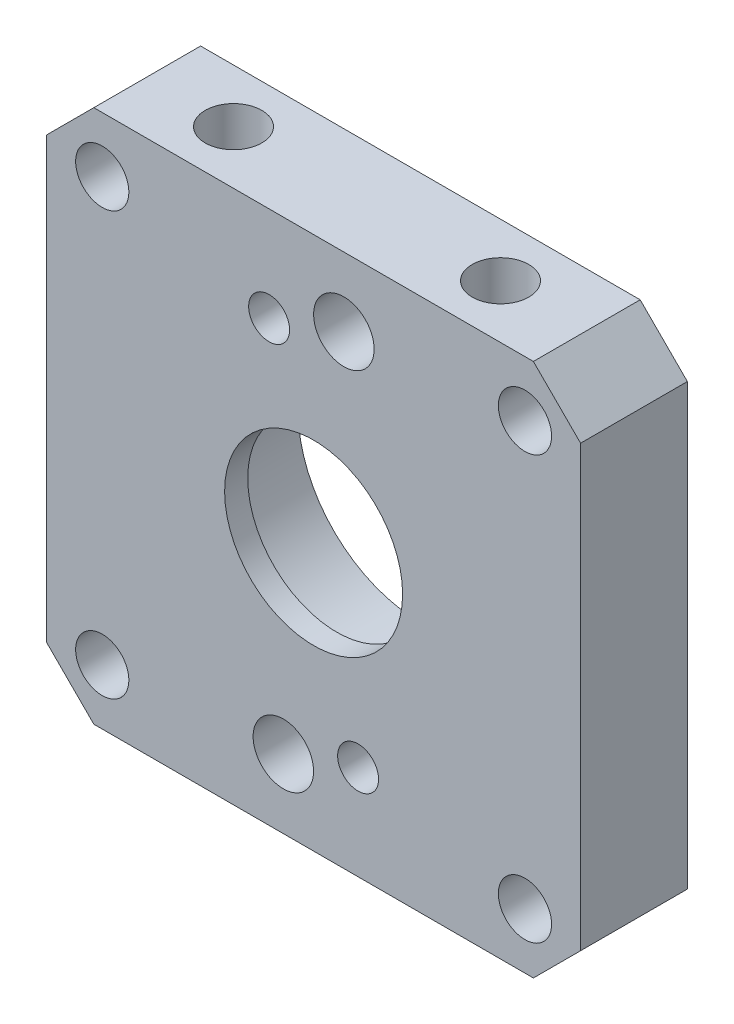
ISO-10303-21;
HEADER;
FILE_DESCRIPTION(('STEP AP214'),'2;1');
FILE_NAME('part.step','',(''),(''),'','','');
FILE_SCHEMA(('AUTOMOTIVE_DESIGN { 1 0 10303 214 1 1 1 1 }'));
ENDSEC;
DATA;
#1=APPLICATION_CONTEXT('core data for automotive mechanical design processes');
#2=APPLICATION_PROTOCOL_DEFINITION('international standard','automotive_design',2000,#1);
#3=PRODUCT_CONTEXT('',#1,'mechanical');
#4=PRODUCT('Part','Part','',(#3));
#5=PRODUCT_RELATED_PRODUCT_CATEGORY('part','',(#4));
#6=PRODUCT_DEFINITION_FORMATION('','',#4);
#7=PRODUCT_DEFINITION_CONTEXT('part definition',#1,'design');
#8=PRODUCT_DEFINITION('design','',#6,#7);
#9=PRODUCT_DEFINITION_SHAPE('','',#8);
#10=(LENGTH_UNIT() NAMED_UNIT(*) SI_UNIT(.MILLI.,.METRE.));
#11=(NAMED_UNIT(*) PLANE_ANGLE_UNIT() SI_UNIT($,.RADIAN.));
#12=(NAMED_UNIT(*) SI_UNIT($,.STERADIAN.) SOLID_ANGLE_UNIT());
#13=UNCERTAINTY_MEASURE_WITH_UNIT(LENGTH_MEASURE(1.E-05),#10,'distance_accuracy_value','');
#14=(GEOMETRIC_REPRESENTATION_CONTEXT(3) GLOBAL_UNCERTAINTY_ASSIGNED_CONTEXT((#13)) GLOBAL_UNIT_ASSIGNED_CONTEXT((#10,
#11,#12)) REPRESENTATION_CONTEXT('',''));
#15=CARTESIAN_POINT('',(0.,0.,0.));
#16=DIRECTION('',(0.,0.,1.));
#17=DIRECTION('',(1.,0.,0.));
#18=AXIS2_PLACEMENT_3D('',#15,#16,#17);
#19=CARTESIAN_POINT('',(9.525,11.4300000000185,-3.81));
#20=DIRECTION('',(0.,1.,0.));
#21=DIRECTION('',(0.,0.,1.));
#22=AXIS2_PLACEMENT_3D('',#19,#20,#21);
#23=CONICAL_SURFACE('',#22,2.01929999992813,1.02974425865271);
#24=CARTESIAN_POINT('',(9.525,10.2166821520484,-3.80999999994316));
#25=VERTEX_POINT('',#24);
#26=VERTEX_LOOP('',#25);
#27=FACE_BOUND('',#26,.T.);
#28=CARTESIAN_POINT('',(9.525,11.43,-3.81));
#29=DIRECTION('',(0.,1.,0.));
#30=DIRECTION('',(0.,0.,1.));
#31=AXIS2_PLACEMENT_3D('',#28,#29,#30);
#32=CIRCLE('',#31,2.01929999999999);
#33=CARTESIAN_POINT('',(9.525,11.43,-1.79070000000001));
#34=VERTEX_POINT('',#33);
#35=EDGE_CURVE('E88',#34,#34,#32,.T.);
#36=ORIENTED_EDGE('',*,*,#35,.T.);
#37=EDGE_LOOP('',(#36));
#38=FACE_BOUND('',#37,.T.);
#39=ADVANCED_FACE('F16',(#27,#38),#23,.F.);
#40=CARTESIAN_POINT('',(-9.525,11.4300000000185,-3.81));
#41=DIRECTION('',(0.,1.,0.));
#42=DIRECTION('',(0.,0.,1.));
#43=AXIS2_PLACEMENT_3D('',#40,#41,#42);
#44=CONICAL_SURFACE('',#43,2.01929999992813,1.02974425865271);
#45=CARTESIAN_POINT('',(-9.525,10.2166821520768,-3.80999999998721));
#46=VERTEX_POINT('',#45);
#47=VERTEX_LOOP('',#46);
#48=FACE_BOUND('',#47,.T.);
#49=CARTESIAN_POINT('',(-9.525,11.43,-3.81));
#50=DIRECTION('',(0.,1.,0.));
#51=DIRECTION('',(0.,0.,1.));
#52=AXIS2_PLACEMENT_3D('',#49,#50,#51);
#53=CIRCLE('',#52,2.01929999999999);
#54=CARTESIAN_POINT('',(-9.525,11.43,-1.79070000000001));
#55=VERTEX_POINT('',#54);
#56=EDGE_CURVE('E90',#55,#55,#53,.T.);
#57=ORIENTED_EDGE('',*,*,#56,.T.);
#58=EDGE_LOOP('',(#57));
#59=FACE_BOUND('',#58,.T.);
#60=ADVANCED_FACE('F85',(#48,#59),#44,.F.);
#61=CARTESIAN_POINT('',(0.,0.,-1.651));
#62=DIRECTION('',(0.,0.,-1.));
#63=DIRECTION('',(-1.,0.,0.));
#64=AXIS2_PLACEMENT_3D('',#61,#62,#63);
#65=CYLINDRICAL_SURFACE('',#64,8.73125);
#66=CARTESIAN_POINT('',(0.,0.,-7.62));
#67=DIRECTION('',(0.,0.,-1.));
#68=DIRECTION('',(-1.,0.,0.));
#69=AXIS2_PLACEMENT_3D('',#66,#67,#68);
#70=CIRCLE('',#69,8.73125);
#71=CARTESIAN_POINT('',(-8.73125,0.,-7.62));
#72=VERTEX_POINT('',#71);
#73=EDGE_CURVE('E93',#72,#72,#70,.F.);
#74=ORIENTED_EDGE('',*,*,#73,.F.);
#75=EDGE_LOOP('',(#74));
#76=FACE_BOUND('',#75,.T.);
#77=CARTESIAN_POINT('',(0.,0.,-1.651));
#78=DIRECTION('',(0.,0.,-1.));
#79=DIRECTION('',(-1.,0.,0.));
#80=AXIS2_PLACEMENT_3D('',#77,#78,#79);
#81=CIRCLE('',#80,8.73125);
#82=CARTESIAN_POINT('',(-8.73125,0.,-1.651));
#83=VERTEX_POINT('',#82);
#84=EDGE_CURVE('E19',#83,#83,#81,.T.);
#85=ORIENTED_EDGE('',*,*,#84,.F.);
#86=EDGE_LOOP('',(#85));
#87=FACE_BOUND('',#86,.T.);
#88=ADVANCED_FACE('F167',(#76,#87),#65,.F.);
#89=CARTESIAN_POINT('',(0.,0.,-1.651));
#90=DIRECTION('',(0.,0.,-1.));
#91=DIRECTION('',(-1.,0.,0.));
#92=AXIS2_PLACEMENT_3D('',#89,#90,#91);
#93=PLANE('',#92);
#94=ORIENTED_EDGE('',*,*,#84,.T.);
#95=EDGE_LOOP('',(#94));
#96=FACE_BOUND('',#95,.T.);
#97=CARTESIAN_POINT('',(0.,0.,-1.651));
#98=DIRECTION('',(0.,0.,-1.));
#99=DIRECTION('',(-1.,0.,0.));
#100=AXIS2_PLACEMENT_3D('',#97,#98,#99);
#101=CIRCLE('',#100,6.35);
#102=CARTESIAN_POINT('',(-6.35,0.,-1.651));
#103=VERTEX_POINT('',#102);
#104=EDGE_CURVE('E147',#103,#103,#101,.F.);
#105=ORIENTED_EDGE('',*,*,#104,.T.);
#106=EDGE_LOOP('',(#105));
#107=FACE_BOUND('',#106,.T.);
#108=ADVANCED_FACE('F170',(#96,#107),#93,.T.);
#109=CARTESIAN_POINT('',(9.525,19.05,-3.81));
#110=DIRECTION('',(0.,1.,0.));
#111=DIRECTION('',(0.,0.,1.));
#112=AXIS2_PLACEMENT_3D('',#109,#110,#111);
#113=CYLINDRICAL_SURFACE('',#112,2.01929999999999);
#114=CARTESIAN_POINT('',(9.525,19.05,-3.81));
#115=DIRECTION('',(0.,1.,0.));
#116=DIRECTION('',(0.,0.,1.));
#117=AXIS2_PLACEMENT_3D('',#114,#115,#116);
#118=CIRCLE('',#117,2.01929999999999);
#119=CARTESIAN_POINT('',(9.525,19.05,-1.79070000000001));
#120=VERTEX_POINT('',#119);
#121=EDGE_CURVE('E130',#120,#120,#118,.F.);
#122=ORIENTED_EDGE('',*,*,#121,.F.);
#123=EDGE_LOOP('',(#122));
#124=FACE_BOUND('',#123,.T.);
#125=ORIENTED_EDGE('',*,*,#35,.F.);
#126=EDGE_LOOP('',(#125));
#127=FACE_BOUND('',#126,.T.);
#128=ADVANCED_FACE('F176',(#124,#127),#113,.F.);
#129=CARTESIAN_POINT('',(-9.525,19.05,-3.81));
#130=DIRECTION('',(0.,1.,0.));
#131=DIRECTION('',(0.,0.,1.));
#132=AXIS2_PLACEMENT_3D('',#129,#130,#131);
#133=CYLINDRICAL_SURFACE('',#132,2.01929999999999);
#134=CARTESIAN_POINT('',(-9.525,19.05,-3.81));
#135=DIRECTION('',(0.,1.,0.));
#136=DIRECTION('',(0.,0.,1.));
#137=AXIS2_PLACEMENT_3D('',#134,#135,#136);
#138=CIRCLE('',#137,2.01929999999999);
#139=CARTESIAN_POINT('',(-9.525,19.05,-1.79070000000001));
#140=VERTEX_POINT('',#139);
#141=EDGE_CURVE('E126',#140,#140,#138,.F.);
#142=ORIENTED_EDGE('',*,*,#141,.F.);
#143=EDGE_LOOP('',(#142));
#144=FACE_BOUND('',#143,.T.);
#145=ORIENTED_EDGE('',*,*,#56,.F.);
#146=EDGE_LOOP('',(#145));
#147=FACE_BOUND('',#146,.T.);
#148=ADVANCED_FACE('F274',(#144,#147),#133,.F.);
#149=CARTESIAN_POINT('',(0.,0.,-7.62));
#150=DIRECTION('',(0.,0.,-1.));
#151=DIRECTION('',(-1.,0.,0.));
#152=AXIS2_PLACEMENT_3D('',#149,#150,#151);
#153=PLANE('',#152);
#154=DIRECTION('',(0.,1.,0.));
#155=VECTOR('',#154,1.);
#156=CARTESIAN_POINT('',(19.05,-19.05,-7.62));
#157=LINE('',#156,#155);
#158=CARTESIAN_POINT('',(19.05,-15.682403954599,-7.62));
#159=VERTEX_POINT('',#158);
#160=CARTESIAN_POINT('',(19.05,15.682403954599,-7.62));
#161=VERTEX_POINT('',#160);
#162=EDGE_CURVE('E460',#159,#161,#157,.T.);
#163=ORIENTED_EDGE('',*,*,#162,.F.);
#164=DIRECTION('',(-0.707106781186543,-0.707106781186552,0.));
#165=VECTOR('',#164,1.);
#166=CARTESIAN_POINT('',(19.05,-15.682403954599,-7.62));
#167=LINE('',#166,#165);
#168=CARTESIAN_POINT('',(15.6824039545991,-19.05,-7.62));
#169=VERTEX_POINT('',#168);
#170=EDGE_CURVE('E475',#159,#169,#167,.T.);
#171=ORIENTED_EDGE('',*,*,#170,.T.);
#172=DIRECTION('',(1.,0.,0.));
#173=VECTOR('',#172,1.);
#174=CARTESIAN_POINT('',(-19.05,-19.05,-7.62));
#175=LINE('',#174,#173);
#176=CARTESIAN_POINT('',(-15.6824039545991,-19.05,-7.62));
#177=VERTEX_POINT('',#176);
#178=EDGE_CURVE('E488',#177,#169,#175,.T.);
#179=ORIENTED_EDGE('',*,*,#178,.F.);
#180=DIRECTION('',(0.707106781186543,-0.707106781186552,0.));
#181=VECTOR('',#180,1.);
#182=CARTESIAN_POINT('',(-19.05,-15.682403954599,-7.62));
#183=LINE('',#182,#181);
#184=CARTESIAN_POINT('',(-19.05,-15.682403954599,-7.62));
#185=VERTEX_POINT('',#184);
#186=EDGE_CURVE('E512',#185,#177,#183,.T.);
#187=ORIENTED_EDGE('',*,*,#186,.F.);
#188=DIRECTION('',(0.,1.,0.));
#189=VECTOR('',#188,1.);
#190=CARTESIAN_POINT('',(-19.05,-19.05,-7.62));
#191=LINE('',#190,#189);
#192=CARTESIAN_POINT('',(-19.05,15.682403954599,-7.62));
#193=VERTEX_POINT('',#192);
#194=EDGE_CURVE('E137',#193,#185,#191,.F.);
#195=ORIENTED_EDGE('',*,*,#194,.F.);
#196=DIRECTION('',(0.707106781186543,0.707106781186552,0.));
#197=VECTOR('',#196,1.);
#198=CARTESIAN_POINT('',(-19.05,15.682403954599,-7.62));
#199=LINE('',#198,#197);
#200=CARTESIAN_POINT('',(-15.6824039545991,19.05,-7.62));
#201=VERTEX_POINT('',#200);
#202=EDGE_CURVE('E133',#193,#201,#199,.T.);
#203=ORIENTED_EDGE('',*,*,#202,.T.);
#204=DIRECTION('',(1.,0.,0.));
#205=VECTOR('',#204,1.);
#206=CARTESIAN_POINT('',(-19.05,19.05,-7.62));
#207=LINE('',#206,#205);
#208=CARTESIAN_POINT('',(15.6824039545991,19.05,-7.62));
#209=VERTEX_POINT('',#208);
#210=EDGE_CURVE('E129',#209,#201,#207,.F.);
#211=ORIENTED_EDGE('',*,*,#210,.F.);
#212=DIRECTION('',(-0.707106781186543,0.707106781186552,0.));
#213=VECTOR('',#212,1.);
#214=CARTESIAN_POINT('',(19.05,15.682403954599,-7.62));
#215=LINE('',#214,#213);
#216=EDGE_CURVE('E478',#161,#209,#215,.T.);
#217=ORIENTED_EDGE('',*,*,#216,.F.);
#218=EDGE_LOOP('',(#163,#171,#179,#187,#195,#203,#211,#217));
#219=FACE_BOUND('',#218,.T.);
#220=CARTESIAN_POINT('',(-15.08125,-15.08125,-7.62));
#221=DIRECTION('',(0.,0.,1.));
#222=DIRECTION('',(1.,0.,0.));
#223=AXIS2_PLACEMENT_3D('',#220,#221,#222);
#224=CIRCLE('',#223,1.89864999999999);
#225=CARTESIAN_POINT('',(-13.1826,-15.08125,-7.62));
#226=VERTEX_POINT('',#225);
#227=EDGE_CURVE('E134',#226,#226,#224,.T.);
#228=ORIENTED_EDGE('',*,*,#227,.T.);
#229=EDGE_LOOP('',(#228));
#230=FACE_BOUND('',#229,.T.);
#231=CARTESIAN_POINT('',(15.08125,-15.08125,-7.62));
#232=DIRECTION('',(0.,0.,1.));
#233=DIRECTION('',(1.,0.,0.));
#234=AXIS2_PLACEMENT_3D('',#231,#232,#233);
#235=CIRCLE('',#234,1.89864999999999);
#236=CARTESIAN_POINT('',(16.9799,-15.08125,-7.62));
#237=VERTEX_POINT('',#236);
#238=EDGE_CURVE('E138',#237,#237,#235,.T.);
#239=ORIENTED_EDGE('',*,*,#238,.T.);
#240=EDGE_LOOP('',(#239));
#241=FACE_BOUND('',#240,.T.);
#242=CARTESIAN_POINT('',(15.08125,15.08125,-7.62));
#243=DIRECTION('',(0.,0.,1.));
#244=DIRECTION('',(1.,0.,0.));
#245=AXIS2_PLACEMENT_3D('',#242,#243,#244);
#246=CIRCLE('',#245,1.89864999999999);
#247=CARTESIAN_POINT('',(16.9799,15.08125,-7.62));
#248=VERTEX_POINT('',#247);
#249=EDGE_CURVE('E141',#248,#248,#246,.T.);
#250=ORIENTED_EDGE('',*,*,#249,.T.);
#251=EDGE_LOOP('',(#250));
#252=FACE_BOUND('',#251,.T.);
#253=CARTESIAN_POINT('',(-15.08125,15.08125,-7.62));
#254=DIRECTION('',(0.,0.,1.));
#255=DIRECTION('',(1.,0.,0.));
#256=AXIS2_PLACEMENT_3D('',#253,#254,#255);
#257=CIRCLE('',#256,1.89864999999999);
#258=CARTESIAN_POINT('',(-13.1826,15.08125,-7.62));
#259=VERTEX_POINT('',#258);
#260=EDGE_CURVE('E144',#259,#259,#257,.T.);
#261=ORIENTED_EDGE('',*,*,#260,.T.);
#262=EDGE_LOOP('',(#261));
#263=FACE_BOUND('',#262,.T.);
#264=ORIENTED_EDGE('',*,*,#73,.T.);
#265=EDGE_LOOP('',(#264));
#266=FACE_BOUND('',#265,.T.);
#267=CARTESIAN_POINT('',(2.159,14.1234335503092,-7.62));
#268=DIRECTION('',(0.,0.,-1.));
#269=DIRECTION('',(-1.,0.,0.));
#270=AXIS2_PLACEMENT_3D('',#267,#268,#269);
#271=CIRCLE('',#270,2.159);
#272=CARTESIAN_POINT('',(0.,14.1234335503092,-7.62));
#273=VERTEX_POINT('',#272);
#274=EDGE_CURVE('E150',#273,#273,#271,.F.);
#275=ORIENTED_EDGE('',*,*,#274,.T.);
#276=EDGE_LOOP('',(#275));
#277=FACE_BOUND('',#276,.T.);
#278=CARTESIAN_POINT('',(-3.175,12.2967221242086,-7.62));
#279=DIRECTION('',(0.,0.,-1.));
#280=DIRECTION('',(-1.,0.,0.));
#281=AXIS2_PLACEMENT_3D('',#278,#279,#280);
#282=CIRCLE('',#281,1.4605);
#283=CARTESIAN_POINT('',(-4.6355,12.2967221242086,-7.62));
#284=VERTEX_POINT('',#283);
#285=EDGE_CURVE('E153',#284,#284,#282,.F.);
#286=ORIENTED_EDGE('',*,*,#285,.T.);
#287=EDGE_LOOP('',(#286));
#288=FACE_BOUND('',#287,.T.);
#289=CARTESIAN_POINT('',(3.175,-12.2967221242086,-7.62));
#290=DIRECTION('',(0.,0.,-1.));
#291=DIRECTION('',(-1.,0.,0.));
#292=AXIS2_PLACEMENT_3D('',#289,#290,#291);
#293=CIRCLE('',#292,1.4605);
#294=CARTESIAN_POINT('',(1.7145,-12.2967221242086,-7.62));
#295=VERTEX_POINT('',#294);
#296=EDGE_CURVE('E156',#295,#295,#293,.F.);
#297=ORIENTED_EDGE('',*,*,#296,.T.);
#298=EDGE_LOOP('',(#297));
#299=FACE_BOUND('',#298,.T.);
#300=CARTESIAN_POINT('',(-2.159,-14.1234335503092,-7.62));
#301=DIRECTION('',(0.,0.,-1.));
#302=DIRECTION('',(-1.,0.,0.));
#303=AXIS2_PLACEMENT_3D('',#300,#301,#302);
#304=CIRCLE('',#303,2.159);
#305=CARTESIAN_POINT('',(-4.318,-14.1234335503092,-7.62));
#306=VERTEX_POINT('',#305);
#307=EDGE_CURVE('E159',#306,#306,#304,.F.);
#308=ORIENTED_EDGE('',*,*,#307,.T.);
#309=EDGE_LOOP('',(#308));
#310=FACE_BOUND('',#309,.T.);
#311=ADVANCED_FACE('F164',(#219,#230,#241,#252,#263,#266,#277,#288,#299,#310),#153,.T.);
#312=CARTESIAN_POINT('',(-2.159,-14.1234335503092,0.));
#313=DIRECTION('',(0.,0.,-1.));
#314=DIRECTION('',(-1.,0.,0.));
#315=AXIS2_PLACEMENT_3D('',#312,#313,#314);
#316=CYLINDRICAL_SURFACE('',#315,2.159);
#317=CARTESIAN_POINT('',(-2.159,-14.1234335503092,0.));
#318=DIRECTION('',(0.,0.,-1.));
#319=DIRECTION('',(-1.,0.,0.));
#320=AXIS2_PLACEMENT_3D('',#317,#318,#319);
#321=CIRCLE('',#320,2.159);
#322=CARTESIAN_POINT('',(-4.318,-14.1234335503092,0.));
#323=VERTEX_POINT('',#322);
#324=EDGE_CURVE('E123',#323,#323,#321,.F.);
#325=ORIENTED_EDGE('',*,*,#324,.T.);
#326=EDGE_LOOP('',(#325));
#327=FACE_BOUND('',#326,.T.);
#328=ORIENTED_EDGE('',*,*,#307,.F.);
#329=EDGE_LOOP('',(#328));
#330=FACE_BOUND('',#329,.T.);
#331=ADVANCED_FACE('F266',(#327,#330),#316,.F.);
#332=CARTESIAN_POINT('',(3.175,-12.2967221242086,0.));
#333=DIRECTION('',(0.,0.,-1.));
#334=DIRECTION('',(-1.,0.,0.));
#335=AXIS2_PLACEMENT_3D('',#332,#333,#334);
#336=CYLINDRICAL_SURFACE('',#335,1.4605);
#337=CARTESIAN_POINT('',(3.175,-12.2967221242086,0.));
#338=DIRECTION('',(0.,0.,-1.));
#339=DIRECTION('',(-1.,0.,0.));
#340=AXIS2_PLACEMENT_3D('',#337,#338,#339);
#341=CIRCLE('',#340,1.4605);
#342=CARTESIAN_POINT('',(1.7145,-12.2967221242086,0.));
#343=VERTEX_POINT('',#342);
#344=EDGE_CURVE('E120',#343,#343,#341,.F.);
#345=ORIENTED_EDGE('',*,*,#344,.T.);
#346=EDGE_LOOP('',(#345));
#347=FACE_BOUND('',#346,.T.);
#348=ORIENTED_EDGE('',*,*,#296,.F.);
#349=EDGE_LOOP('',(#348));
#350=FACE_BOUND('',#349,.T.);
#351=ADVANCED_FACE('F269',(#347,#350),#336,.F.);
#352=CARTESIAN_POINT('',(-3.175,12.2967221242086,0.));
#353=DIRECTION('',(0.,0.,-1.));
#354=DIRECTION('',(-1.,0.,0.));
#355=AXIS2_PLACEMENT_3D('',#352,#353,#354);
#356=CYLINDRICAL_SURFACE('',#355,1.4605);
#357=CARTESIAN_POINT('',(-3.175,12.2967221242086,0.));
#358=DIRECTION('',(0.,0.,-1.));
#359=DIRECTION('',(-1.,0.,0.));
#360=AXIS2_PLACEMENT_3D('',#357,#358,#359);
#361=CIRCLE('',#360,1.4605);
#362=CARTESIAN_POINT('',(-4.6355,12.2967221242086,0.));
#363=VERTEX_POINT('',#362);
#364=EDGE_CURVE('E117',#363,#363,#361,.F.);
#365=ORIENTED_EDGE('',*,*,#364,.T.);
#366=EDGE_LOOP('',(#365));
#367=FACE_BOUND('',#366,.T.);
#368=ORIENTED_EDGE('',*,*,#285,.F.);
#369=EDGE_LOOP('',(#368));
#370=FACE_BOUND('',#369,.T.);
#371=ADVANCED_FACE('F194',(#367,#370),#356,.F.);
#372=CARTESIAN_POINT('',(2.159,14.1234335503092,0.));
#373=DIRECTION('',(0.,0.,-1.));
#374=DIRECTION('',(-1.,0.,0.));
#375=AXIS2_PLACEMENT_3D('',#372,#373,#374);
#376=CYLINDRICAL_SURFACE('',#375,2.159);
#377=CARTESIAN_POINT('',(2.159,14.1234335503092,0.));
#378=DIRECTION('',(0.,0.,-1.));
#379=DIRECTION('',(-1.,0.,0.));
#380=AXIS2_PLACEMENT_3D('',#377,#378,#379);
#381=CIRCLE('',#380,2.159);
#382=CARTESIAN_POINT('',(0.,14.1234335503092,0.));
#383=VERTEX_POINT('',#382);
#384=EDGE_CURVE('E114',#383,#383,#381,.F.);
#385=ORIENTED_EDGE('',*,*,#384,.T.);
#386=EDGE_LOOP('',(#385));
#387=FACE_BOUND('',#386,.T.);
#388=ORIENTED_EDGE('',*,*,#274,.F.);
#389=EDGE_LOOP('',(#388));
#390=FACE_BOUND('',#389,.T.);
#391=ADVANCED_FACE('F183',(#387,#390),#376,.F.);
#392=CARTESIAN_POINT('',(0.,0.,4.318));
#393=DIRECTION('',(0.,0.,-1.));
#394=DIRECTION('',(-1.,0.,0.));
#395=AXIS2_PLACEMENT_3D('',#392,#393,#394);
#396=CYLINDRICAL_SURFACE('',#395,6.35);
#397=CARTESIAN_POINT('',(0.,0.,0.));
#398=DIRECTION('',(0.,0.,-1.));
#399=DIRECTION('',(-1.,0.,0.));
#400=AXIS2_PLACEMENT_3D('',#397,#398,#399);
#401=CIRCLE('',#400,6.35);
#402=CARTESIAN_POINT('',(-6.35,0.,0.));
#403=VERTEX_POINT('',#402);
#404=EDGE_CURVE('E111',#403,#403,#401,.F.);
#405=ORIENTED_EDGE('',*,*,#404,.T.);
#406=EDGE_LOOP('',(#405));
#407=FACE_BOUND('',#406,.T.);
#408=ORIENTED_EDGE('',*,*,#104,.F.);
#409=EDGE_LOOP('',(#408));
#410=FACE_BOUND('',#409,.T.);
#411=ADVANCED_FACE('F180',(#407,#410),#396,.F.);
#412=CARTESIAN_POINT('',(-15.08125,15.08125,0.));
#413=DIRECTION('',(0.,0.,1.));
#414=DIRECTION('',(1.,0.,0.));
#415=AXIS2_PLACEMENT_3D('',#412,#413,#414);
#416=CYLINDRICAL_SURFACE('',#415,1.89864999999999);
#417=ORIENTED_EDGE('',*,*,#260,.F.);
#418=EDGE_LOOP('',(#417));
#419=FACE_BOUND('',#418,.T.);
#420=CARTESIAN_POINT('',(-15.08125,15.08125,0.));
#421=DIRECTION('',(0.,0.,1.));
#422=DIRECTION('',(1.,0.,0.));
#423=AXIS2_PLACEMENT_3D('',#420,#421,#422);
#424=CIRCLE('',#423,1.89864999999999);
#425=CARTESIAN_POINT('',(-13.1826,15.08125,0.));
#426=VERTEX_POINT('',#425);
#427=EDGE_CURVE('E108',#426,#426,#424,.T.);
#428=ORIENTED_EDGE('',*,*,#427,.T.);
#429=EDGE_LOOP('',(#428));
#430=FACE_BOUND('',#429,.T.);
#431=ADVANCED_FACE('F182',(#419,#430),#416,.F.);
#432=CARTESIAN_POINT('',(15.08125,15.08125,0.));
#433=DIRECTION('',(0.,0.,1.));
#434=DIRECTION('',(1.,0.,0.));
#435=AXIS2_PLACEMENT_3D('',#432,#433,#434);
#436=CYLINDRICAL_SURFACE('',#435,1.89864999999999);
#437=ORIENTED_EDGE('',*,*,#249,.F.);
#438=EDGE_LOOP('',(#437));
#439=FACE_BOUND('',#438,.T.);
#440=CARTESIAN_POINT('',(15.08125,15.08125,0.));
#441=DIRECTION('',(0.,0.,1.));
#442=DIRECTION('',(1.,0.,0.));
#443=AXIS2_PLACEMENT_3D('',#440,#441,#442);
#444=CIRCLE('',#443,1.89864999999999);
#445=CARTESIAN_POINT('',(16.9799,15.08125,0.));
#446=VERTEX_POINT('',#445);
#447=EDGE_CURVE('E105',#446,#446,#444,.T.);
#448=ORIENTED_EDGE('',*,*,#447,.T.);
#449=EDGE_LOOP('',(#448));
#450=FACE_BOUND('',#449,.T.);
#451=ADVANCED_FACE('F191',(#439,#450),#436,.F.);
#452=CARTESIAN_POINT('',(15.08125,-15.08125,0.));
#453=DIRECTION('',(0.,0.,1.));
#454=DIRECTION('',(1.,0.,0.));
#455=AXIS2_PLACEMENT_3D('',#452,#453,#454);
#456=CYLINDRICAL_SURFACE('',#455,1.89864999999999);
#457=ORIENTED_EDGE('',*,*,#238,.F.);
#458=EDGE_LOOP('',(#457));
#459=FACE_BOUND('',#458,.T.);
#460=CARTESIAN_POINT('',(15.08125,-15.08125,0.));
#461=DIRECTION('',(0.,0.,1.));
#462=DIRECTION('',(1.,0.,0.));
#463=AXIS2_PLACEMENT_3D('',#460,#461,#462);
#464=CIRCLE('',#463,1.89864999999999);
#465=CARTESIAN_POINT('',(16.9799,-15.08125,0.));
#466=VERTEX_POINT('',#465);
#467=EDGE_CURVE('E102',#466,#466,#464,.T.);
#468=ORIENTED_EDGE('',*,*,#467,.T.);
#469=EDGE_LOOP('',(#468));
#470=FACE_BOUND('',#469,.T.);
#471=ADVANCED_FACE('F240',(#459,#470),#456,.F.);
#472=CARTESIAN_POINT('',(-15.08125,-15.08125,0.));
#473=DIRECTION('',(0.,0.,1.));
#474=DIRECTION('',(1.,0.,0.));
#475=AXIS2_PLACEMENT_3D('',#472,#473,#474);
#476=CYLINDRICAL_SURFACE('',#475,1.89864999999999);
#477=ORIENTED_EDGE('',*,*,#227,.F.);
#478=EDGE_LOOP('',(#477));
#479=FACE_BOUND('',#478,.T.);
#480=CARTESIAN_POINT('',(-15.08125,-15.08125,0.));
#481=DIRECTION('',(0.,0.,1.));
#482=DIRECTION('',(1.,0.,0.));
#483=AXIS2_PLACEMENT_3D('',#480,#481,#482);
#484=CIRCLE('',#483,1.89864999999999);
#485=CARTESIAN_POINT('',(-13.1826,-15.08125,0.));
#486=VERTEX_POINT('',#485);
#487=EDGE_CURVE('E98',#486,#486,#484,.T.);
#488=ORIENTED_EDGE('',*,*,#487,.T.);
#489=EDGE_LOOP('',(#488));
#490=FACE_BOUND('',#489,.T.);
#491=ADVANCED_FACE('F236',(#479,#490),#476,.F.);
#492=CARTESIAN_POINT('',(-19.05,-19.05,-7.62));
#493=DIRECTION('',(-1.,0.,0.));
#494=DIRECTION('',(0.,0.,1.));
#495=AXIS2_PLACEMENT_3D('',#492,#493,#494);
#496=PLANE('',#495);
#497=DIRECTION('',(0.,1.,0.));
#498=VECTOR('',#497,1.);
#499=CARTESIAN_POINT('',(-19.05,0.,0.));
#500=LINE('',#499,#498);
#501=CARTESIAN_POINT('',(-19.05,-15.682403954599,0.));
#502=VERTEX_POINT('',#501);
#503=CARTESIAN_POINT('',(-19.05,15.682403954599,0.));
#504=VERTEX_POINT('',#503);
#505=EDGE_CURVE('E101',#502,#504,#500,.T.);
#506=ORIENTED_EDGE('',*,*,#505,.T.);
#507=DIRECTION('',(0.,0.,1.));
#508=VECTOR('',#507,1.);
#509=CARTESIAN_POINT('',(-19.05,15.682403954599,-7.62));
#510=LINE('',#509,#508);
#511=EDGE_CURVE('E504',#504,#193,#510,.F.);
#512=ORIENTED_EDGE('',*,*,#511,.T.);
#513=ORIENTED_EDGE('',*,*,#194,.T.);
#514=DIRECTION('',(0.,0.,1.));
#515=VECTOR('',#514,1.);
#516=CARTESIAN_POINT('',(-19.05,-15.682403954599,-7.62));
#517=LINE('',#516,#515);
#518=EDGE_CURVE('E509',#502,#185,#517,.F.);
#519=ORIENTED_EDGE('',*,*,#518,.F.);
#520=EDGE_LOOP('',(#506,#512,#513,#519));
#521=FACE_BOUND('',#520,.T.);
#522=ADVANCED_FACE('F232',(#521),#496,.T.);
#523=CARTESIAN_POINT('',(-19.05,15.682403954599,-7.62));
#524=DIRECTION('',(0.707106781186552,-0.707106781186543,0.));
#525=DIRECTION('',(0.707106781186543,0.707106781186552,0.));
#526=AXIS2_PLACEMENT_3D('',#523,#524,#525);
#527=PLANE('',#526);
#528=DIRECTION('',(0.,0.,1.));
#529=VECTOR('',#528,1.);
#530=CARTESIAN_POINT('',(-15.6824039545991,19.05,-7.62));
#531=LINE('',#530,#529);
#532=CARTESIAN_POINT('',(-15.6824039545991,19.05,0.));
#533=VERTEX_POINT('',#532);
#534=EDGE_CURVE('E499',#201,#533,#531,.T.);
#535=ORIENTED_EDGE('',*,*,#534,.F.);
#536=ORIENTED_EDGE('',*,*,#202,.F.);
#537=ORIENTED_EDGE('',*,*,#511,.F.);
#538=DIRECTION('',(0.707106781186542,0.707106781186553,0.));
#539=VECTOR('',#538,1.);
#540=CARTESIAN_POINT('',(-19.05,15.682403954599,0.));
#541=LINE('',#540,#539);
#542=EDGE_CURVE('E530',#504,#533,#541,.T.);
#543=ORIENTED_EDGE('',*,*,#542,.T.);
#544=EDGE_LOOP('',(#535,#536,#537,#543));
#545=FACE_BOUND('',#544,.T.);
#546=ADVANCED_FACE('F228',(#545),#527,.F.);
#547=CARTESIAN_POINT('',(-19.05,19.05,-7.62));
#548=DIRECTION('',(0.,1.,0.));
#549=DIRECTION('',(0.,0.,1.));
#550=AXIS2_PLACEMENT_3D('',#547,#548,#549);
#551=PLANE('',#550);
#552=ORIENTED_EDGE('',*,*,#210,.T.);
#553=ORIENTED_EDGE('',*,*,#534,.T.);
#554=DIRECTION('',(-1.,0.,0.));
#555=VECTOR('',#554,1.);
#556=CARTESIAN_POINT('',(0.,19.05,0.));
#557=LINE('',#556,#555);
#558=CARTESIAN_POINT('',(15.6824039545991,19.05,0.));
#559=VERTEX_POINT('',#558);
#560=EDGE_CURVE('E527',#533,#559,#557,.F.);
#561=ORIENTED_EDGE('',*,*,#560,.T.);
#562=DIRECTION('',(0.,0.,1.));
#563=VECTOR('',#562,1.);
#564=CARTESIAN_POINT('',(15.6824039545991,19.05,-7.62));
#565=LINE('',#564,#563);
#566=EDGE_CURVE('E482',#209,#559,#565,.T.);
#567=ORIENTED_EDGE('',*,*,#566,.F.);
#568=EDGE_LOOP('',(#552,#553,#561,#567));
#569=FACE_BOUND('',#568,.T.);
#570=ORIENTED_EDGE('',*,*,#141,.T.);
#571=EDGE_LOOP('',(#570));
#572=FACE_BOUND('',#571,.T.);
#573=ORIENTED_EDGE('',*,*,#121,.T.);
#574=EDGE_LOOP('',(#573));
#575=FACE_BOUND('',#574,.T.);
#576=ADVANCED_FACE('F224',(#569,#572,#575),#551,.T.);
#577=CARTESIAN_POINT('',(19.05,15.682403954599,-7.62));
#578=DIRECTION('',(0.707106781186552,0.707106781186543,0.));
#579=DIRECTION('',(-0.707106781186543,0.707106781186552,0.));
#580=AXIS2_PLACEMENT_3D('',#577,#578,#579);
#581=PLANE('',#580);
#582=ORIENTED_EDGE('',*,*,#216,.T.);
#583=ORIENTED_EDGE('',*,*,#566,.T.);
#584=DIRECTION('',(0.707106781186545,-0.70710678118655,0.));
#585=VECTOR('',#584,1.);
#586=CARTESIAN_POINT('',(15.6824039545991,19.05,0.));
#587=LINE('',#586,#585);
#588=CARTESIAN_POINT('',(19.05,15.682403954599,0.));
#589=VERTEX_POINT('',#588);
#590=EDGE_CURVE('E524',#559,#589,#587,.T.);
#591=ORIENTED_EDGE('',*,*,#590,.T.);
#592=DIRECTION('',(0.,0.,-1.));
#593=VECTOR('',#592,1.);
#594=CARTESIAN_POINT('',(19.05,15.682403954599,-7.62));
#595=LINE('',#594,#593);
#596=EDGE_CURVE('E481',#161,#589,#595,.F.);
#597=ORIENTED_EDGE('',*,*,#596,.F.);
#598=EDGE_LOOP('',(#582,#583,#591,#597));
#599=FACE_BOUND('',#598,.T.);
#600=ADVANCED_FACE('F220',(#599),#581,.T.);
#601=CARTESIAN_POINT('',(19.05,-19.05,-7.62));
#602=DIRECTION('',(1.,0.,0.));
#603=DIRECTION('',(0.,0.,-1.));
#604=AXIS2_PLACEMENT_3D('',#601,#602,#603);
#605=PLANE('',#604);
#606=ORIENTED_EDGE('',*,*,#596,.T.);
#607=DIRECTION('',(0.,1.,0.));
#608=VECTOR('',#607,1.);
#609=CARTESIAN_POINT('',(19.05,0.,0.));
#610=LINE('',#609,#608);
#611=CARTESIAN_POINT('',(19.05,-15.682403954599,0.));
#612=VERTEX_POINT('',#611);
#613=EDGE_CURVE('E492',#589,#612,#610,.F.);
#614=ORIENTED_EDGE('',*,*,#613,.T.);
#615=DIRECTION('',(0.,0.,1.));
#616=VECTOR('',#615,1.);
#617=CARTESIAN_POINT('',(19.05,-15.682403954599,-7.62));
#618=LINE('',#617,#616);
#619=EDGE_CURVE('E485',#612,#159,#618,.F.);
#620=ORIENTED_EDGE('',*,*,#619,.T.);
#621=ORIENTED_EDGE('',*,*,#162,.T.);
#622=EDGE_LOOP('',(#606,#614,#620,#621));
#623=FACE_BOUND('',#622,.T.);
#624=ADVANCED_FACE('F216',(#623),#605,.T.);
#625=CARTESIAN_POINT('',(19.05,-15.682403954599,-7.62));
#626=DIRECTION('',(-0.707106781186552,0.707106781186543,0.));
#627=DIRECTION('',(-0.707106781186543,-0.707106781186552,0.));
#628=AXIS2_PLACEMENT_3D('',#625,#626,#627);
#629=PLANE('',#628);
#630=DIRECTION('',(0.,0.,-1.));
#631=VECTOR('',#630,1.);
#632=CARTESIAN_POINT('',(15.6824039545991,-19.05,-7.62));
#633=LINE('',#632,#631);
#634=CARTESIAN_POINT('',(15.6824039545991,-19.05,0.));
#635=VERTEX_POINT('',#634);
#636=EDGE_CURVE('E487',#169,#635,#633,.F.);
#637=ORIENTED_EDGE('',*,*,#636,.F.);
#638=ORIENTED_EDGE('',*,*,#170,.F.);
#639=ORIENTED_EDGE('',*,*,#619,.F.);
#640=DIRECTION('',(-0.707106781186545,-0.70710678118655,0.));
#641=VECTOR('',#640,1.);
#642=CARTESIAN_POINT('',(19.05,-15.682403954599,0.));
#643=LINE('',#642,#641);
#644=EDGE_CURVE('E519',#612,#635,#643,.T.);
#645=ORIENTED_EDGE('',*,*,#644,.T.);
#646=EDGE_LOOP('',(#637,#638,#639,#645));
#647=FACE_BOUND('',#646,.T.);
#648=ADVANCED_FACE('F212',(#647),#629,.F.);
#649=CARTESIAN_POINT('',(-19.05,-19.05,-7.62));
#650=DIRECTION('',(0.,-1.,0.));
#651=DIRECTION('',(0.,0.,-1.));
#652=AXIS2_PLACEMENT_3D('',#649,#650,#651);
#653=PLANE('',#652);
#654=ORIENTED_EDGE('',*,*,#178,.T.);
#655=ORIENTED_EDGE('',*,*,#636,.T.);
#656=DIRECTION('',(-1.,0.,0.));
#657=VECTOR('',#656,1.);
#658=CARTESIAN_POINT('',(0.,-19.05,0.));
#659=LINE('',#658,#657);
#660=CARTESIAN_POINT('',(-15.6824039545991,-19.05,0.));
#661=VERTEX_POINT('',#660);
#662=EDGE_CURVE('E25',#635,#661,#659,.T.);
#663=ORIENTED_EDGE('',*,*,#662,.T.);
#664=DIRECTION('',(0.,0.,1.));
#665=VECTOR('',#664,1.);
#666=CARTESIAN_POINT('',(-15.6824039545991,-19.05,-7.62));
#667=LINE('',#666,#665);
#668=EDGE_CURVE('E33',#177,#661,#667,.T.);
#669=ORIENTED_EDGE('',*,*,#668,.F.);
#670=EDGE_LOOP('',(#654,#655,#663,#669));
#671=FACE_BOUND('',#670,.T.);
#672=ADVANCED_FACE('F205',(#671),#653,.T.);
#673=CARTESIAN_POINT('',(-19.05,-15.682403954599,-7.62));
#674=DIRECTION('',(-0.707106781186552,-0.707106781186543,0.));
#675=DIRECTION('',(0.707106781186543,-0.707106781186552,0.));
#676=AXIS2_PLACEMENT_3D('',#673,#674,#675);
#677=PLANE('',#676);
#678=ORIENTED_EDGE('',*,*,#186,.T.);
#679=ORIENTED_EDGE('',*,*,#668,.T.);
#680=DIRECTION('',(-0.707106781186543,0.707106781186552,0.));
#681=VECTOR('',#680,1.);
#682=CARTESIAN_POINT('',(-15.6824039545991,-19.05,0.));
#683=LINE('',#682,#681);
#684=EDGE_CURVE('E11',#661,#502,#683,.T.);
#685=ORIENTED_EDGE('',*,*,#684,.T.);
#686=ORIENTED_EDGE('',*,*,#518,.T.);
#687=EDGE_LOOP('',(#678,#679,#685,#686));
#688=FACE_BOUND('',#687,.T.);
#689=ADVANCED_FACE('F199',(#688),#677,.T.);
#690=CARTESIAN_POINT('',(0.,0.,0.));
#691=DIRECTION('',(0.,0.,-1.));
#692=DIRECTION('',(-1.,0.,0.));
#693=AXIS2_PLACEMENT_3D('',#690,#691,#692);
#694=PLANE('',#693);
#695=ORIENTED_EDGE('',*,*,#662,.F.);
#696=ORIENTED_EDGE('',*,*,#644,.F.);
#697=ORIENTED_EDGE('',*,*,#613,.F.);
#698=ORIENTED_EDGE('',*,*,#590,.F.);
#699=ORIENTED_EDGE('',*,*,#560,.F.);
#700=ORIENTED_EDGE('',*,*,#542,.F.);
#701=ORIENTED_EDGE('',*,*,#505,.F.);
#702=ORIENTED_EDGE('',*,*,#684,.F.);
#703=EDGE_LOOP('',(#695,#696,#697,#698,#699,#700,#701,#702));
#704=FACE_BOUND('',#703,.T.);
#705=ORIENTED_EDGE('',*,*,#487,.F.);
#706=EDGE_LOOP('',(#705));
#707=FACE_BOUND('',#706,.T.);
#708=ORIENTED_EDGE('',*,*,#467,.F.);
#709=EDGE_LOOP('',(#708));
#710=FACE_BOUND('',#709,.T.);
#711=ORIENTED_EDGE('',*,*,#447,.F.);
#712=EDGE_LOOP('',(#711));
#713=FACE_BOUND('',#712,.T.);
#714=ORIENTED_EDGE('',*,*,#427,.F.);
#715=EDGE_LOOP('',(#714));
#716=FACE_BOUND('',#715,.T.);
#717=ORIENTED_EDGE('',*,*,#404,.F.);
#718=EDGE_LOOP('',(#717));
#719=FACE_BOUND('',#718,.T.);
#720=ORIENTED_EDGE('',*,*,#384,.F.);
#721=EDGE_LOOP('',(#720));
#722=FACE_BOUND('',#721,.T.);
#723=ORIENTED_EDGE('',*,*,#364,.F.);
#724=EDGE_LOOP('',(#723));
#725=FACE_BOUND('',#724,.T.);
#726=ORIENTED_EDGE('',*,*,#344,.F.);
#727=EDGE_LOOP('',(#726));
#728=FACE_BOUND('',#727,.T.);
#729=ORIENTED_EDGE('',*,*,#324,.F.);
#730=EDGE_LOOP('',(#729));
#731=FACE_BOUND('',#730,.T.);
#732=ADVANCED_FACE('F197',(#704,#707,#710,#713,#716,#719,#722,#725,#728,#731),#694,.F.);
#733=CLOSED_SHELL('',(#39,#60,#88,#108,#128,#148,#311,#331,#351,#371,#391,#411,#431,#451,#471,
#491,#522,#546,#576,#600,#624,#648,#672,#689,#732));
#734=MANIFOLD_SOLID_BREP('B1',#733);
#735=ADVANCED_BREP_SHAPE_REPRESENTATION('',(#18,#734),#14);
#736=SHAPE_DEFINITION_REPRESENTATION(#9,#735);
ENDSEC;
END-ISO-10303-21;
